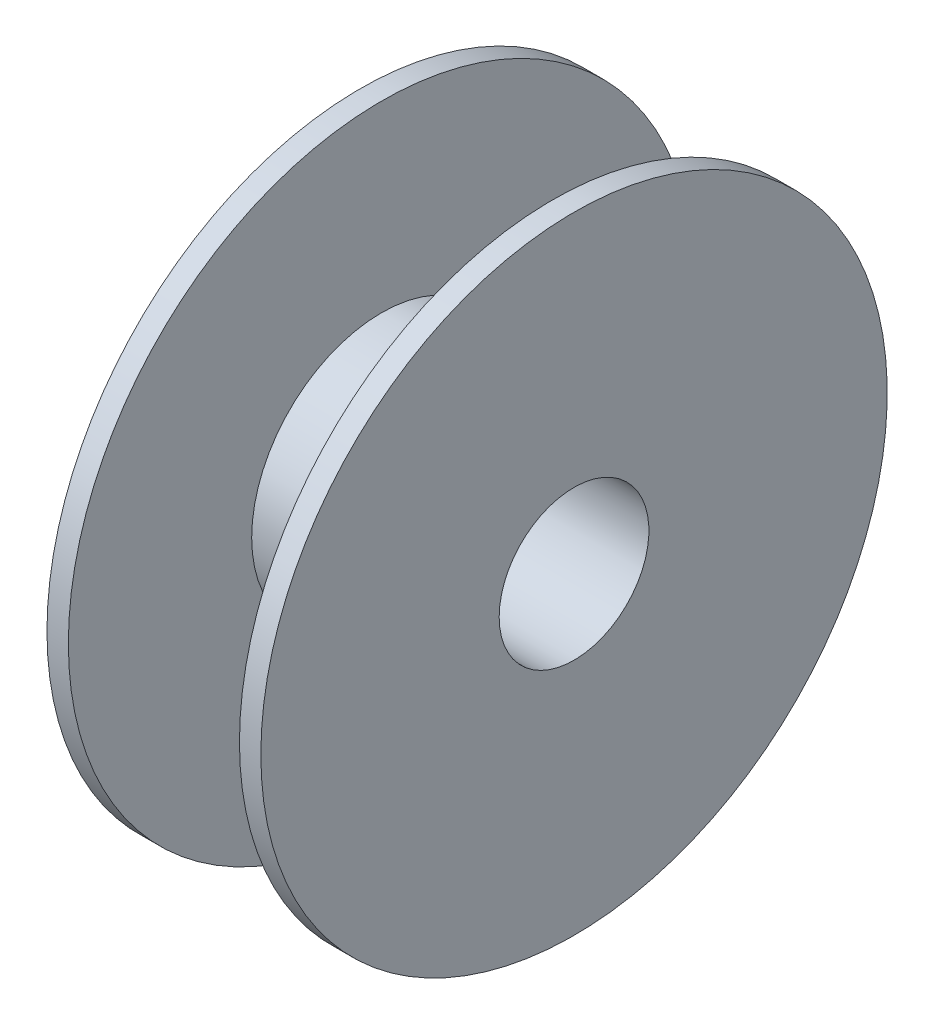
ISO-10303-21;
HEADER;
FILE_DESCRIPTION(('STEP AP214'),'2;1');
FILE_NAME('part.step','',(''),(''),'','','');
FILE_SCHEMA(('AUTOMOTIVE_DESIGN { 1 0 10303 214 1 1 1 1 }'));
ENDSEC;
DATA;
#1=APPLICATION_CONTEXT('core data for automotive mechanical design processes');
#2=APPLICATION_PROTOCOL_DEFINITION('international standard','automotive_design',2000,#1);
#3=PRODUCT_CONTEXT('',#1,'mechanical');
#4=PRODUCT('Part','Part','',(#3));
#5=PRODUCT_RELATED_PRODUCT_CATEGORY('part','',(#4));
#6=PRODUCT_DEFINITION_FORMATION('','',#4);
#7=PRODUCT_DEFINITION_CONTEXT('part definition',#1,'design');
#8=PRODUCT_DEFINITION('design','',#6,#7);
#9=PRODUCT_DEFINITION_SHAPE('','',#8);
#10=(LENGTH_UNIT() NAMED_UNIT(*) SI_UNIT(.MILLI.,.METRE.));
#11=(NAMED_UNIT(*) PLANE_ANGLE_UNIT() SI_UNIT($,.RADIAN.));
#12=(NAMED_UNIT(*) SI_UNIT($,.STERADIAN.) SOLID_ANGLE_UNIT());
#13=UNCERTAINTY_MEASURE_WITH_UNIT(LENGTH_MEASURE(1.E-05),#10,'distance_accuracy_value','');
#14=(GEOMETRIC_REPRESENTATION_CONTEXT(3) GLOBAL_UNCERTAINTY_ASSIGNED_CONTEXT((#13)) GLOBAL_UNIT_ASSIGNED_CONTEXT((#10,
#11,#12)) REPRESENTATION_CONTEXT('',''));
#15=CARTESIAN_POINT('',(0.,0.,0.));
#16=DIRECTION('',(0.,0.,1.));
#17=DIRECTION('',(1.,0.,0.));
#18=AXIS2_PLACEMENT_3D('',#15,#16,#17);
#19=CARTESIAN_POINT('',(-72.7317073170732,0.,0.));
#20=DIRECTION('',(-1.,0.,0.));
#21=DIRECTION('',(0.,0.,1.));
#22=AXIS2_PLACEMENT_3D('',#19,#20,#21);
#23=CYLINDRICAL_SURFACE('',#22,102.5);
#24=CARTESIAN_POINT('',(-35.,0.,0.));
#25=DIRECTION('',(-1.,0.,0.));
#26=DIRECTION('',(0.,0.,1.));
#27=AXIS2_PLACEMENT_3D('',#24,#25,#26);
#28=CIRCLE('',#27,102.5);
#29=CARTESIAN_POINT('',(-35.,0.,102.5));
#30=VERTEX_POINT('',#29);
#31=EDGE_CURVE('E10',#30,#30,#28,.T.);
#32=ORIENTED_EDGE('',*,*,#31,.F.);
#33=EDGE_LOOP('',(#32));
#34=FACE_BOUND('',#33,.T.);
#35=CARTESIAN_POINT('',(-28.,0.,0.));
#36=DIRECTION('',(-1.,0.,0.));
#37=DIRECTION('',(0.,0.,1.));
#38=AXIS2_PLACEMENT_3D('',#35,#36,#37);
#39=CIRCLE('',#38,102.5);
#40=CARTESIAN_POINT('',(-28.,0.,102.5));
#41=VERTEX_POINT('',#40);
#42=EDGE_CURVE('E60',#41,#41,#39,.T.);
#43=ORIENTED_EDGE('',*,*,#42,.T.);
#44=EDGE_LOOP('',(#43));
#45=FACE_BOUND('',#44,.T.);
#46=ADVANCED_FACE('F32',(#34,#45),#23,.T.);
#47=CARTESIAN_POINT('',(-35.,0.,-102.5));
#48=DIRECTION('',(1.,0.,0.));
#49=DIRECTION('',(0.,0.,-1.));
#50=AXIS2_PLACEMENT_3D('',#47,#48,#49);
#51=PLANE('',#50);
#52=CARTESIAN_POINT('',(-35.,0.,0.));
#53=DIRECTION('',(-1.,0.,0.));
#54=DIRECTION('',(0.,0.,1.));
#55=AXIS2_PLACEMENT_3D('',#52,#53,#54);
#56=CIRCLE('',#55,24.5);
#57=CARTESIAN_POINT('',(-35.,0.,24.5));
#58=VERTEX_POINT('',#57);
#59=EDGE_CURVE('E38',#58,#58,#56,.T.);
#60=ORIENTED_EDGE('',*,*,#59,.F.);
#61=EDGE_LOOP('',(#60));
#62=FACE_BOUND('',#61,.T.);
#63=ORIENTED_EDGE('',*,*,#31,.T.);
#64=EDGE_LOOP('',(#63));
#65=FACE_BOUND('',#64,.T.);
#66=ADVANCED_FACE('F97',(#62,#65),#51,.F.);
#67=CARTESIAN_POINT('',(-72.7317073170732,0.,0.));
#68=DIRECTION('',(-1.,0.,0.));
#69=DIRECTION('',(0.,0.,1.));
#70=AXIS2_PLACEMENT_3D('',#67,#68,#69);
#71=CYLINDRICAL_SURFACE('',#70,24.5);
#72=CARTESIAN_POINT('',(35.,0.,0.));
#73=DIRECTION('',(-1.,0.,0.));
#74=DIRECTION('',(0.,0.,1.));
#75=AXIS2_PLACEMENT_3D('',#72,#73,#74);
#76=CIRCLE('',#75,24.5);
#77=CARTESIAN_POINT('',(35.,0.,24.5));
#78=VERTEX_POINT('',#77);
#79=EDGE_CURVE('E42',#78,#78,#76,.T.);
#80=ORIENTED_EDGE('',*,*,#79,.F.);
#81=EDGE_LOOP('',(#80));
#82=FACE_BOUND('',#81,.T.);
#83=ORIENTED_EDGE('',*,*,#59,.T.);
#84=EDGE_LOOP('',(#83));
#85=FACE_BOUND('',#84,.T.);
#86=ADVANCED_FACE('F92',(#82,#85),#71,.F.);
#87=CARTESIAN_POINT('',(35.,0.,-24.5));
#88=DIRECTION('',(-1.,0.,0.));
#89=DIRECTION('',(0.,0.,1.));
#90=AXIS2_PLACEMENT_3D('',#87,#88,#89);
#91=PLANE('',#90);
#92=CARTESIAN_POINT('',(35.,0.,0.));
#93=DIRECTION('',(-1.,0.,0.));
#94=DIRECTION('',(0.,0.,1.));
#95=AXIS2_PLACEMENT_3D('',#92,#93,#94);
#96=CIRCLE('',#95,102.5);
#97=CARTESIAN_POINT('',(35.,0.,102.5));
#98=VERTEX_POINT('',#97);
#99=EDGE_CURVE('E46',#98,#98,#96,.T.);
#100=ORIENTED_EDGE('',*,*,#99,.F.);
#101=EDGE_LOOP('',(#100));
#102=FACE_BOUND('',#101,.T.);
#103=ORIENTED_EDGE('',*,*,#79,.T.);
#104=EDGE_LOOP('',(#103));
#105=FACE_BOUND('',#104,.T.);
#106=ADVANCED_FACE('F86',(#102,#105),#91,.F.);
#107=CARTESIAN_POINT('',(-72.7317073170732,0.,0.));
#108=DIRECTION('',(-1.,0.,0.));
#109=DIRECTION('',(0.,0.,1.));
#110=AXIS2_PLACEMENT_3D('',#107,#108,#109);
#111=CYLINDRICAL_SURFACE('',#110,102.5);
#112=CARTESIAN_POINT('',(28.,0.,0.));
#113=DIRECTION('',(-1.,0.,0.));
#114=DIRECTION('',(0.,0.,1.));
#115=AXIS2_PLACEMENT_3D('',#112,#113,#114);
#116=CIRCLE('',#115,102.5);
#117=CARTESIAN_POINT('',(28.,0.,102.5));
#118=VERTEX_POINT('',#117);
#119=EDGE_CURVE('E51',#118,#118,#116,.T.);
#120=ORIENTED_EDGE('',*,*,#119,.F.);
#121=EDGE_LOOP('',(#120));
#122=FACE_BOUND('',#121,.T.);
#123=ORIENTED_EDGE('',*,*,#99,.T.);
#124=EDGE_LOOP('',(#123));
#125=FACE_BOUND('',#124,.T.);
#126=ADVANCED_FACE('F80',(#122,#125),#111,.T.);
#127=CARTESIAN_POINT('',(28.,0.,-102.5));
#128=DIRECTION('',(1.,0.,0.));
#129=DIRECTION('',(0.,0.,-1.));
#130=AXIS2_PLACEMENT_3D('',#127,#128,#129);
#131=PLANE('',#130);
#132=CARTESIAN_POINT('',(28.,0.,0.));
#133=DIRECTION('',(-1.,0.,0.));
#134=DIRECTION('',(0.,0.,1.));
#135=AXIS2_PLACEMENT_3D('',#132,#133,#134);
#136=CIRCLE('',#135,42.5);
#137=CARTESIAN_POINT('',(28.,0.,42.5));
#138=VERTEX_POINT('',#137);
#139=EDGE_CURVE('E54',#138,#138,#136,.T.);
#140=ORIENTED_EDGE('',*,*,#139,.F.);
#141=EDGE_LOOP('',(#140));
#142=FACE_BOUND('',#141,.T.);
#143=ORIENTED_EDGE('',*,*,#119,.T.);
#144=EDGE_LOOP('',(#143));
#145=FACE_BOUND('',#144,.T.);
#146=ADVANCED_FACE('F74',(#142,#145),#131,.F.);
#147=CARTESIAN_POINT('',(-72.7317073170732,0.,0.));
#148=DIRECTION('',(-1.,0.,0.));
#149=DIRECTION('',(0.,0.,1.));
#150=AXIS2_PLACEMENT_3D('',#147,#148,#149);
#151=CYLINDRICAL_SURFACE('',#150,42.5);
#152=CARTESIAN_POINT('',(-28.,0.,0.));
#153=DIRECTION('',(-1.,0.,0.));
#154=DIRECTION('',(0.,0.,1.));
#155=AXIS2_PLACEMENT_3D('',#152,#153,#154);
#156=CIRCLE('',#155,42.5);
#157=CARTESIAN_POINT('',(-28.,0.,42.5));
#158=VERTEX_POINT('',#157);
#159=EDGE_CURVE('E57',#158,#158,#156,.T.);
#160=ORIENTED_EDGE('',*,*,#159,.F.);
#161=EDGE_LOOP('',(#160));
#162=FACE_BOUND('',#161,.T.);
#163=ORIENTED_EDGE('',*,*,#139,.T.);
#164=EDGE_LOOP('',(#163));
#165=FACE_BOUND('',#164,.T.);
#166=ADVANCED_FACE('F68',(#162,#165),#151,.T.);
#167=CARTESIAN_POINT('',(-28.,0.,-42.5));
#168=DIRECTION('',(-1.,0.,0.));
#169=DIRECTION('',(0.,0.,1.));
#170=AXIS2_PLACEMENT_3D('',#167,#168,#169);
#171=PLANE('',#170);
#172=ORIENTED_EDGE('',*,*,#42,.F.);
#173=EDGE_LOOP('',(#172));
#174=FACE_BOUND('',#173,.T.);
#175=ORIENTED_EDGE('',*,*,#159,.T.);
#176=EDGE_LOOP('',(#175));
#177=FACE_BOUND('',#176,.T.);
#178=ADVANCED_FACE('F65',(#174,#177),#171,.F.);
#179=CLOSED_SHELL('',(#46,#66,#86,#106,#126,#146,#166,#178));
#180=MANIFOLD_SOLID_BREP('B2',#179);
#181=ADVANCED_BREP_SHAPE_REPRESENTATION('',(#18,#180),#14);
#182=SHAPE_DEFINITION_REPRESENTATION(#9,#181);
ENDSEC;
END-ISO-10303-21;
